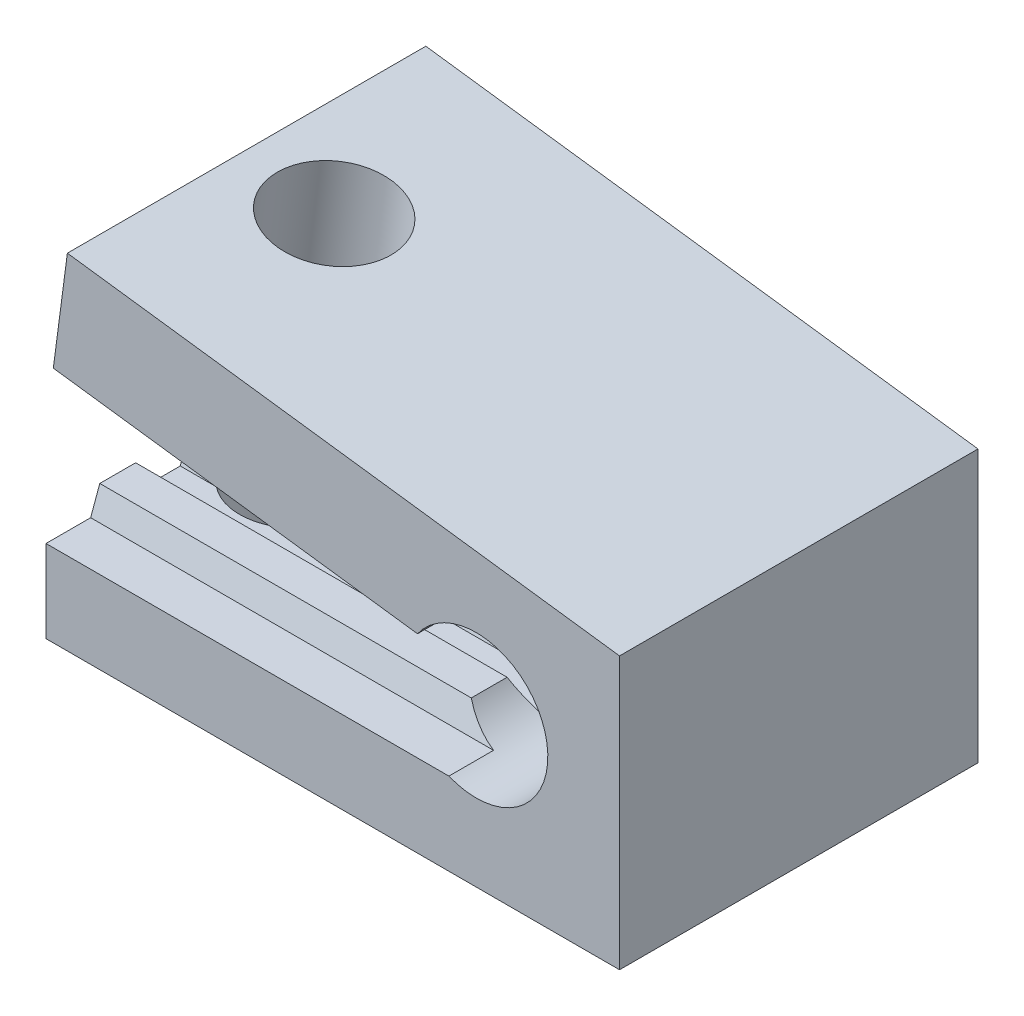
ISO-10303-21;
HEADER;
FILE_DESCRIPTION(('STEP AP214'),'2;1');
FILE_NAME('part.step','',(''),(''),'','','');
FILE_SCHEMA(('AUTOMOTIVE_DESIGN { 1 0 10303 214 1 1 1 1 }'));
ENDSEC;
DATA;
#1=APPLICATION_CONTEXT('core data for automotive mechanical design processes');
#2=APPLICATION_PROTOCOL_DEFINITION('international standard','automotive_design',2000,#1);
#3=PRODUCT_CONTEXT('',#1,'mechanical');
#4=PRODUCT('Part','Part','',(#3));
#5=PRODUCT_RELATED_PRODUCT_CATEGORY('part','',(#4));
#6=PRODUCT_DEFINITION_FORMATION('','',#4);
#7=PRODUCT_DEFINITION_CONTEXT('part definition',#1,'design');
#8=PRODUCT_DEFINITION('design','',#6,#7);
#9=PRODUCT_DEFINITION_SHAPE('','',#8);
#10=(LENGTH_UNIT() NAMED_UNIT(*) SI_UNIT(.MILLI.,.METRE.));
#11=(NAMED_UNIT(*) PLANE_ANGLE_UNIT() SI_UNIT($,.RADIAN.));
#12=(NAMED_UNIT(*) SI_UNIT($,.STERADIAN.) SOLID_ANGLE_UNIT());
#13=UNCERTAINTY_MEASURE_WITH_UNIT(LENGTH_MEASURE(1.E-05),#10,'distance_accuracy_value','');
#14=(GEOMETRIC_REPRESENTATION_CONTEXT(3) GLOBAL_UNCERTAINTY_ASSIGNED_CONTEXT((#13)) GLOBAL_UNIT_ASSIGNED_CONTEXT((#10,
#11,#12)) REPRESENTATION_CONTEXT('',''));
#15=CARTESIAN_POINT('',(0.,0.,0.));
#16=DIRECTION('',(0.,0.,1.));
#17=DIRECTION('',(1.,0.,0.));
#18=AXIS2_PLACEMENT_3D('',#15,#16,#17);
#19=CARTESIAN_POINT('',(0.,2.65,5.));
#20=DIRECTION('',(0.,0.,-1.));
#21=DIRECTION('',(-1.,0.,0.));
#22=AXIS2_PLACEMENT_3D('',#19,#20,#21);
#23=CYLINDRICAL_SURFACE('',#22,2.);
#24=DIRECTION('',(0.,0.,-1.));
#25=VECTOR('',#24,1.);
#26=CARTESIAN_POINT('',(-0.759934207678538,0.800000000000007,5.));
#27=LINE('',#26,#25);
#28=CARTESIAN_POINT('',(-0.759934207678538,0.800000000000007,5.));
#29=VERTEX_POINT('',#28);
#30=CARTESIAN_POINT('',(-0.759934207678538,0.800000000000007,3.75477916398634));
#31=VERTEX_POINT('',#30);
#32=EDGE_CURVE('E333',#29,#31,#27,.T.);
#33=ORIENTED_EDGE('',*,*,#32,.F.);
#34=CARTESIAN_POINT('',(0.,2.65,5.));
#35=DIRECTION('',(0.,0.,-1.));
#36=DIRECTION('',(1.,0.,0.));
#37=AXIS2_PLACEMENT_3D('',#34,#35,#36);
#38=CIRCLE('',#37,2.);
#39=CARTESIAN_POINT('',(-1.63630681719536,3.8,5.));
#40=VERTEX_POINT('',#39);
#41=EDGE_CURVE('E293',#40,#29,#38,.T.);
#42=ORIENTED_EDGE('',*,*,#41,.F.);
#43=DIRECTION('',(0.,0.,-1.));
#44=VECTOR('',#43,1.);
#45=CARTESIAN_POINT('',(-1.63630681719536,3.8,5.));
#46=LINE('',#45,#44);
#47=CARTESIAN_POINT('',(-1.63630681719536,3.8,-5.));
#48=VERTEX_POINT('',#47);
#49=EDGE_CURVE('E283',#40,#48,#46,.T.);
#50=ORIENTED_EDGE('',*,*,#49,.T.);
#51=CARTESIAN_POINT('',(0.,2.65,-5.));
#52=DIRECTION('',(0.,0.,-1.));
#53=DIRECTION('',(1.,0.,0.));
#54=AXIS2_PLACEMENT_3D('',#51,#52,#53);
#55=CIRCLE('',#54,2.);
#56=CARTESIAN_POINT('',(-1.63630681719536,1.5,-5.));
#57=VERTEX_POINT('',#56);
#58=EDGE_CURVE('E298',#48,#57,#55,.T.);
#59=ORIENTED_EDGE('',*,*,#58,.T.);
#60=DIRECTION('',(0.,0.,-1.));
#61=VECTOR('',#60,1.);
#62=CARTESIAN_POINT('',(-1.63630681719536,1.5,5.));
#63=LINE('',#62,#61);
#64=CARTESIAN_POINT('',(-1.63630681719536,1.50000000000001,-4.));
#65=VERTEX_POINT('',#64);
#66=EDGE_CURVE('E287',#65,#57,#63,.T.);
#67=ORIENTED_EDGE('',*,*,#66,.F.);
#68=CARTESIAN_POINT('',(0.,2.65,-4.41856576940613));
#69=DIRECTION('',(0.,0.342020143325668,0.939692620785909));
#70=DIRECTION('',(0.,0.939692620785909,-0.342020143325668));
#71=AXIS2_PLACEMENT_3D('',#68,#69,#70);
#72=ELLIPSE('',#71,2.12835554495182,2.);
#73=CARTESIAN_POINT('',(-0.759934207678538,0.800000000000007,-3.74522083601366));
#74=VERTEX_POINT('',#73);
#75=EDGE_CURVE('E459',#74,#65,#72,.F.);
#76=ORIENTED_EDGE('',*,*,#75,.F.);
#77=DIRECTION('',(0.,0.,-1.));
#78=VECTOR('',#77,1.);
#79=CARTESIAN_POINT('',(-0.759934207678533,0.800000000000005,5.));
#80=LINE('',#79,#78);
#81=CARTESIAN_POINT('',(-0.759934207678533,0.800000000000005,-2.75477916398634));
#82=VERTEX_POINT('',#81);
#83=EDGE_CURVE('E468',#82,#74,#80,.T.);
#84=ORIENTED_EDGE('',*,*,#83,.F.);
#85=CARTESIAN_POINT('',(0.,2.65,-2.08143423059387));
#86=DIRECTION('',(0.,0.342020143325669,-0.939692620785908));
#87=DIRECTION('',(0.,-0.939692620785908,-0.342020143325669));
#88=AXIS2_PLACEMENT_3D('',#85,#86,#87);
#89=ELLIPSE('',#88,2.12835554495182,2.);
#90=CARTESIAN_POINT('',(-1.63630681719536,1.5,-2.5));
#91=VERTEX_POINT('',#90);
#92=EDGE_CURVE('E471',#91,#82,#89,.F.);
#93=ORIENTED_EDGE('',*,*,#92,.F.);
#94=CARTESIAN_POINT('',(-1.63630681719536,1.5,-1.5));
#95=VERTEX_POINT('',#94);
#96=EDGE_CURVE('E289',#95,#91,#63,.T.);
#97=ORIENTED_EDGE('',*,*,#96,.F.);
#98=CARTESIAN_POINT('',(0.,2.65,-1.91856576940613));
#99=DIRECTION('',(0.,0.342020143325668,0.939692620785909));
#100=DIRECTION('',(0.,0.939692620785909,-0.342020143325668));
#101=AXIS2_PLACEMENT_3D('',#98,#99,#100);
#102=ELLIPSE('',#101,2.12835554495182,2.);
#103=CARTESIAN_POINT('',(-0.759934207678538,0.800000000000007,-1.24522083601366));
#104=VERTEX_POINT('',#103);
#105=EDGE_CURVE('E350',#104,#95,#102,.F.);
#106=ORIENTED_EDGE('',*,*,#105,.F.);
#107=DIRECTION('',(0.,0.,-1.));
#108=VECTOR('',#107,1.);
#109=CARTESIAN_POINT('',(-0.759934207678535,0.800000000000006,5.));
#110=LINE('',#109,#108);
#111=CARTESIAN_POINT('',(-0.759934207678535,0.800000000000006,-0.254779163986342));
#112=VERTEX_POINT('',#111);
#113=EDGE_CURVE('E347',#112,#104,#110,.T.);
#114=ORIENTED_EDGE('',*,*,#113,.F.);
#115=CARTESIAN_POINT('',(0.,2.65,0.418565769406133));
#116=DIRECTION('',(0.,0.342020143325669,-0.939692620785908));
#117=DIRECTION('',(0.,-0.939692620785908,-0.342020143325669));
#118=AXIS2_PLACEMENT_3D('',#115,#116,#117);
#119=ELLIPSE('',#118,2.12835554495182,2.);
#120=CARTESIAN_POINT('',(-1.63630681719536,1.5,0.));
#121=VERTEX_POINT('',#120);
#122=EDGE_CURVE('E344',#121,#112,#119,.F.);
#123=ORIENTED_EDGE('',*,*,#122,.F.);
#124=CARTESIAN_POINT('',(-1.63630681719536,1.5,1.));
#125=VERTEX_POINT('',#124);
#126=EDGE_CURVE('E513',#125,#121,#63,.T.);
#127=ORIENTED_EDGE('',*,*,#126,.F.);
#128=CARTESIAN_POINT('',(0.,2.65,0.581434230593869));
#129=DIRECTION('',(0.,0.342020143325668,0.939692620785909));
#130=DIRECTION('',(0.,0.939692620785909,-0.342020143325668));
#131=AXIS2_PLACEMENT_3D('',#128,#129,#130);
#132=ELLIPSE('',#131,2.12835554495182,2.);
#133=CARTESIAN_POINT('',(-0.759934207678538,0.800000000000007,1.25477916398634));
#134=VERTEX_POINT('',#133);
#135=EDGE_CURVE('E341',#134,#125,#132,.F.);
#136=ORIENTED_EDGE('',*,*,#135,.F.);
#137=DIRECTION('',(0.,0.,-1.));
#138=VECTOR('',#137,1.);
#139=CARTESIAN_POINT('',(-0.759934207678536,0.800000000000006,5.));
#140=LINE('',#139,#138);
#141=CARTESIAN_POINT('',(-0.759934207678536,0.800000000000006,2.24522083601366));
#142=VERTEX_POINT('',#141);
#143=EDGE_CURVE('E338',#142,#134,#140,.T.);
#144=ORIENTED_EDGE('',*,*,#143,.F.);
#145=CARTESIAN_POINT('',(0.,2.65,2.91856576940613));
#146=DIRECTION('',(0.,0.342020143325669,-0.939692620785908));
#147=DIRECTION('',(0.,-0.939692620785908,-0.342020143325669));
#148=AXIS2_PLACEMENT_3D('',#145,#146,#147);
#149=ELLIPSE('',#148,2.12835554495182,2.);
#150=CARTESIAN_POINT('',(-1.63630681719536,1.5,2.5));
#151=VERTEX_POINT('',#150);
#152=EDGE_CURVE('E45',#151,#142,#149,.F.);
#153=ORIENTED_EDGE('',*,*,#152,.F.);
#154=CARTESIAN_POINT('',(-1.63630681719536,1.50000000000001,3.5));
#155=VERTEX_POINT('',#154);
#156=EDGE_CURVE('E286',#155,#151,#63,.T.);
#157=ORIENTED_EDGE('',*,*,#156,.F.);
#158=CARTESIAN_POINT('',(0.,2.65,3.08143423059387));
#159=DIRECTION('',(0.,0.342020143325668,0.939692620785909));
#160=DIRECTION('',(0.,0.939692620785909,-0.342020143325668));
#161=AXIS2_PLACEMENT_3D('',#158,#159,#160);
#162=ELLIPSE('',#161,2.12835554495182,2.);
#163=EDGE_CURVE('E11',#31,#155,#162,.F.);
#164=ORIENTED_EDGE('',*,*,#163,.F.);
#165=EDGE_LOOP('',(#33,#42,#50,#59,#67,#76,#84,#93,#97,#106,#114,#123,#127,#136,#144,#153,#157,#164));
#166=FACE_BOUND('',#165,.T.);
#167=ADVANCED_FACE('F37',(#166),#23,.F.);
#168=CARTESIAN_POINT('',(-1.63630681719536,1.5,5.));
#169=DIRECTION('',(0.,-1.,0.));
#170=DIRECTION('',(1.,0.,0.));
#171=AXIS2_PLACEMENT_3D('',#168,#169,#170);
#172=PLANE('',#171);
#173=DIRECTION('',(0.,0.,-1.));
#174=VECTOR('',#173,1.);
#175=CARTESIAN_POINT('',(-12.,1.5,5.));
#176=LINE('',#175,#174);
#177=CARTESIAN_POINT('',(-12.,1.5,3.5));
#178=VERTEX_POINT('',#177);
#179=CARTESIAN_POINT('',(-12.,1.5,2.5));
#180=VERTEX_POINT('',#179);
#181=EDGE_CURVE('E290',#178,#180,#176,.T.);
#182=ORIENTED_EDGE('',*,*,#181,.F.);
#183=DIRECTION('',(1.,0.,0.));
#184=VECTOR('',#183,1.);
#185=CARTESIAN_POINT('',(-38.4689427634904,1.49999999999998,3.5));
#186=LINE('',#185,#184);
#187=EDGE_CURVE('E359',#178,#155,#186,.T.);
#188=ORIENTED_EDGE('',*,*,#187,.T.);
#189=ORIENTED_EDGE('',*,*,#156,.T.);
#190=DIRECTION('',(1.,0.,0.));
#191=VECTOR('',#190,1.);
#192=CARTESIAN_POINT('',(-38.4689427634904,1.49999999999998,2.5));
#193=LINE('',#192,#191);
#194=EDGE_CURVE('E362',#180,#151,#193,.T.);
#195=ORIENTED_EDGE('',*,*,#194,.F.);
#196=EDGE_LOOP('',(#182,#188,#189,#195));
#197=FACE_BOUND('',#196,.T.);
#198=ADVANCED_FACE('F420',(#197),#172,.F.);
#199=CARTESIAN_POINT('',(-12.,1.5,1.));
#200=VERTEX_POINT('',#199);
#201=CARTESIAN_POINT('',(-12.,1.5,0.));
#202=VERTEX_POINT('',#201);
#203=EDGE_CURVE('E422',#200,#202,#176,.T.);
#204=ORIENTED_EDGE('',*,*,#203,.F.);
#205=DIRECTION('',(1.,0.,0.));
#206=VECTOR('',#205,1.);
#207=CARTESIAN_POINT('',(-38.4689427634904,1.49999999999998,1.));
#208=LINE('',#207,#206);
#209=CARTESIAN_POINT('',(-11.2489995996797,1.5,1.));
#210=VERTEX_POINT('',#209);
#211=EDGE_CURVE('E372',#200,#210,#208,.T.);
#212=ORIENTED_EDGE('',*,*,#211,.T.);
#213=CARTESIAN_POINT('',(-9.99999999999999,1.5,0.));
#214=DIRECTION('',(0.,-1.,0.));
#215=DIRECTION('',(1.,0.,0.));
#216=AXIS2_PLACEMENT_3D('',#213,#214,#215);
#217=CIRCLE('',#216,1.6);
#218=CARTESIAN_POINT('',(-11.6,1.5,0.));
#219=VERTEX_POINT('',#218);
#220=EDGE_CURVE('E233',#219,#210,#217,.F.);
#221=ORIENTED_EDGE('',*,*,#220,.F.);
#222=DIRECTION('',(1.,0.,0.));
#223=VECTOR('',#222,1.);
#224=CARTESIAN_POINT('',(-38.4689427634904,1.49999999999998,0.));
#225=LINE('',#224,#223);
#226=EDGE_CURVE('E375',#202,#219,#225,.T.);
#227=ORIENTED_EDGE('',*,*,#226,.F.);
#228=EDGE_LOOP('',(#204,#212,#221,#227));
#229=FACE_BOUND('',#228,.T.);
#230=ADVANCED_FACE('F499',(#229),#172,.F.);
#231=CARTESIAN_POINT('',(-8.75100040032031,1.5,1.));
#232=VERTEX_POINT('',#231);
#233=CARTESIAN_POINT('',(-8.39999999999999,1.5,0.));
#234=VERTEX_POINT('',#233);
#235=EDGE_CURVE('E235',#232,#234,#217,.F.);
#236=ORIENTED_EDGE('',*,*,#235,.F.);
#237=EDGE_CURVE('E374',#232,#125,#208,.T.);
#238=ORIENTED_EDGE('',*,*,#237,.T.);
#239=ORIENTED_EDGE('',*,*,#126,.T.);
#240=EDGE_CURVE('E378',#234,#121,#225,.T.);
#241=ORIENTED_EDGE('',*,*,#240,.F.);
#242=EDGE_LOOP('',(#236,#238,#239,#241));
#243=FACE_BOUND('',#242,.T.);
#244=ADVANCED_FACE('F508',(#243),#172,.F.);
#245=CARTESIAN_POINT('',(-12.,1.5,-1.5));
#246=VERTEX_POINT('',#245);
#247=CARTESIAN_POINT('',(-12.,1.5,-2.5));
#248=VERTEX_POINT('',#247);
#249=EDGE_CURVE('E241',#246,#248,#176,.T.);
#250=ORIENTED_EDGE('',*,*,#249,.F.);
#251=DIRECTION('',(1.,0.,0.));
#252=VECTOR('',#251,1.);
#253=CARTESIAN_POINT('',(-38.4689427634904,1.49999999999998,-1.5));
#254=LINE('',#253,#252);
#255=CARTESIAN_POINT('',(-10.556776436283,1.5,-1.5));
#256=VERTEX_POINT('',#255);
#257=EDGE_CURVE('E238',#246,#256,#254,.T.);
#258=ORIENTED_EDGE('',*,*,#257,.T.);
#259=CARTESIAN_POINT('',(-9.44322356371699,1.5,-1.5));
#260=VERTEX_POINT('',#259);
#261=EDGE_CURVE('E222',#260,#256,#217,.F.);
#262=ORIENTED_EDGE('',*,*,#261,.F.);
#263=EDGE_CURVE('E245',#260,#95,#254,.T.);
#264=ORIENTED_EDGE('',*,*,#263,.T.);
#265=ORIENTED_EDGE('',*,*,#96,.T.);
#266=DIRECTION('',(1.,0.,0.));
#267=VECTOR('',#266,1.);
#268=CARTESIAN_POINT('',(-38.4689427634904,1.49999999999998,-2.5));
#269=LINE('',#268,#267);
#270=EDGE_CURVE('E384',#248,#91,#269,.T.);
#271=ORIENTED_EDGE('',*,*,#270,.F.);
#272=EDGE_LOOP('',(#250,#258,#262,#264,#265,#271));
#273=FACE_BOUND('',#272,.T.);
#274=ADVANCED_FACE('F239',(#273),#172,.F.);
#275=CARTESIAN_POINT('',(-9.99999999999999,8.11282375258911,0.));
#276=DIRECTION('',(0.,-1.,0.));
#277=DIRECTION('',(1.,0.,0.));
#278=AXIS2_PLACEMENT_3D('',#275,#276,#277);
#279=CYLINDRICAL_SURFACE('',#278,1.6);
#280=CARTESIAN_POINT('',(-9.99999999999999,-1.5,0.));
#281=DIRECTION('',(0.,-1.,0.));
#282=DIRECTION('',(1.,0.,0.));
#283=AXIS2_PLACEMENT_3D('',#280,#281,#282);
#284=CIRCLE('',#283,1.6);
#285=CARTESIAN_POINT('',(-8.39999999999999,-1.5,0.));
#286=VERTEX_POINT('',#285);
#287=EDGE_CURVE('E331',#286,#286,#284,.T.);
#288=ORIENTED_EDGE('',*,*,#287,.T.);
#289=EDGE_LOOP('',(#288));
#290=FACE_BOUND('',#289,.T.);
#291=CARTESIAN_POINT('',(-9.99999999999999,4.24747741945463,0.));
#292=DIRECTION('',(0.,0.342020143325668,0.939692620785909));
#293=DIRECTION('',(0.,-0.939692620785909,0.342020143325668));
#294=AXIS2_PLACEMENT_3D('',#291,#292,#293);
#295=ELLIPSE('',#294,4.67808704026095,1.6);
#296=CARTESIAN_POINT('',(-10.9927382583671,0.8,1.25477916398634));
#297=VERTEX_POINT('',#296);
#298=EDGE_CURVE('E469',#297,#210,#295,.F.);
#299=ORIENTED_EDGE('',*,*,#298,.F.);
#300=CARTESIAN_POINT('',(-9.99999999999999,0.800000000000001,0.));
#301=DIRECTION('',(0.,1.,0.));
#302=DIRECTION('',(-1.,0.,0.));
#303=AXIS2_PLACEMENT_3D('',#300,#301,#302);
#304=CIRCLE('',#303,1.6);
#305=CARTESIAN_POINT('',(-9.00726174163289,0.800000000000002,1.25477916398634));
#306=VERTEX_POINT('',#305);
#307=EDGE_CURVE('E474',#306,#297,#304,.F.);
#308=ORIENTED_EDGE('',*,*,#307,.F.);
#309=EDGE_CURVE('E476',#232,#306,#295,.F.);
#310=ORIENTED_EDGE('',*,*,#309,.F.);
#311=ORIENTED_EDGE('',*,*,#235,.T.);
#312=CARTESIAN_POINT('',(-9.99999999999999,1.5,0.));
#313=DIRECTION('',(0.,0.342020143325669,-0.939692620785908));
#314=DIRECTION('',(0.,-0.939692620785908,-0.342020143325669));
#315=AXIS2_PLACEMENT_3D('',#312,#313,#314);
#316=ELLIPSE('',#315,4.67808704026094,1.6);
#317=CARTESIAN_POINT('',(-8.42041537814575,0.800000000000002,-0.254779163986342));
#318=VERTEX_POINT('',#317);
#319=EDGE_CURVE('E252',#318,#234,#316,.F.);
#320=ORIENTED_EDGE('',*,*,#319,.F.);
#321=CARTESIAN_POINT('',(-9.99999999999999,0.800000000000001,0.));
#322=DIRECTION('',(0.,1.,0.));
#323=DIRECTION('',(-1.,0.,0.));
#324=AXIS2_PLACEMENT_3D('',#321,#322,#323);
#325=CIRCLE('',#324,1.6);
#326=CARTESIAN_POINT('',(-8.99529851719157,0.800000000000002,-1.24522083601366));
#327=VERTEX_POINT('',#326);
#328=EDGE_CURVE('E256',#327,#318,#325,.F.);
#329=ORIENTED_EDGE('',*,*,#328,.F.);
#330=CARTESIAN_POINT('',(-10.,-2.62121612918194,0.));
#331=DIRECTION('',(0.,0.342020143325668,0.939692620785909));
#332=DIRECTION('',(0.,-0.939692620785909,0.342020143325668));
#333=AXIS2_PLACEMENT_3D('',#330,#331,#332);
#334=ELLIPSE('',#333,4.67808704026095,1.6);
#335=EDGE_CURVE('E229',#260,#327,#334,.F.);
#336=ORIENTED_EDGE('',*,*,#335,.F.);
#337=ORIENTED_EDGE('',*,*,#261,.T.);
#338=CARTESIAN_POINT('',(-11.0047014828084,0.800000000000001,-1.24522083601366));
#339=VERTEX_POINT('',#338);
#340=EDGE_CURVE('E226',#339,#256,#334,.F.);
#341=ORIENTED_EDGE('',*,*,#340,.F.);
#342=CARTESIAN_POINT('',(-11.5795846218542,0.8,-0.254779163986342));
#343=VERTEX_POINT('',#342);
#344=EDGE_CURVE('E251',#343,#339,#325,.F.);
#345=ORIENTED_EDGE('',*,*,#344,.F.);
#346=EDGE_CURVE('E254',#219,#343,#316,.F.);
#347=ORIENTED_EDGE('',*,*,#346,.F.);
#348=ORIENTED_EDGE('',*,*,#220,.T.);
#349=EDGE_LOOP('',(#299,#308,#310,#311,#320,#329,#336,#337,#341,#345,#347,#348));
#350=FACE_BOUND('',#349,.T.);
#351=ADVANCED_FACE('F224',(#290,#350),#279,.F.);
#352=CARTESIAN_POINT('',(-12.,-1.5,5.));
#353=DIRECTION('',(1.,0.,0.));
#354=DIRECTION('',(0.,0.,-1.));
#355=AXIS2_PLACEMENT_3D('',#352,#353,#354);
#356=PLANE('',#355);
#357=DIRECTION('',(0.,-1.,0.));
#358=VECTOR('',#357,1.);
#359=CARTESIAN_POINT('',(-12.,-1.5,5.));
#360=LINE('',#359,#358);
#361=CARTESIAN_POINT('',(-12.,0.800000000000003,5.));
#362=VERTEX_POINT('',#361);
#363=CARTESIAN_POINT('',(-12.,-1.5,5.));
#364=VERTEX_POINT('',#363);
#365=EDGE_CURVE('E297',#362,#364,#360,.T.);
#366=ORIENTED_EDGE('',*,*,#365,.F.);
#367=DIRECTION('',(0.,0.,-1.));
#368=VECTOR('',#367,1.);
#369=CARTESIAN_POINT('',(-12.,0.8,3.75477916398634));
#370=LINE('',#369,#368);
#371=CARTESIAN_POINT('',(-12.,0.8,3.75477916398634));
#372=VERTEX_POINT('',#371);
#373=EDGE_CURVE('E52',#362,#372,#370,.T.);
#374=ORIENTED_EDGE('',*,*,#373,.T.);
#375=DIRECTION('',(0.,0.939692620785909,-0.342020143325668));
#376=VECTOR('',#375,1.);
#377=CARTESIAN_POINT('',(-12.,1.49999999999999,3.5));
#378=LINE('',#377,#376);
#379=EDGE_CURVE('E413',#372,#178,#378,.T.);
#380=ORIENTED_EDGE('',*,*,#379,.T.);
#381=ORIENTED_EDGE('',*,*,#181,.T.);
#382=DIRECTION('',(0.,-0.939692620785908,-0.342020143325669));
#383=VECTOR('',#382,1.);
#384=CARTESIAN_POINT('',(-12.,1.49999999999999,2.49999999999999));
#385=LINE('',#384,#383);
#386=CARTESIAN_POINT('',(-12.,0.8,2.24522083601366));
#387=VERTEX_POINT('',#386);
#388=EDGE_CURVE('E59',#180,#387,#385,.T.);
#389=ORIENTED_EDGE('',*,*,#388,.T.);
#390=DIRECTION('',(0.,0.,-1.));
#391=VECTOR('',#390,1.);
#392=CARTESIAN_POINT('',(-12.,0.8,1.25477916398634));
#393=LINE('',#392,#391);
#394=CARTESIAN_POINT('',(-12.,0.8,1.25477916398634));
#395=VERTEX_POINT('',#394);
#396=EDGE_CURVE('E410',#387,#395,#393,.T.);
#397=ORIENTED_EDGE('',*,*,#396,.T.);
#398=DIRECTION('',(0.,0.939692620785909,-0.342020143325668));
#399=VECTOR('',#398,1.);
#400=CARTESIAN_POINT('',(-12.,1.49999999999999,1.00000000000001));
#401=LINE('',#400,#399);
#402=EDGE_CURVE('E408',#395,#200,#401,.T.);
#403=ORIENTED_EDGE('',*,*,#402,.T.);
#404=ORIENTED_EDGE('',*,*,#203,.T.);
#405=DIRECTION('',(0.,-0.939692620785908,-0.342020143325669));
#406=VECTOR('',#405,1.);
#407=CARTESIAN_POINT('',(-12.,1.49999999999999,0.));
#408=LINE('',#407,#406);
#409=CARTESIAN_POINT('',(-12.,0.8,-0.254779163986342));
#410=VERTEX_POINT('',#409);
#411=EDGE_CURVE('E406',#202,#410,#408,.T.);
#412=ORIENTED_EDGE('',*,*,#411,.T.);
#413=DIRECTION('',(0.,0.,-1.));
#414=VECTOR('',#413,1.);
#415=CARTESIAN_POINT('',(-12.,0.8,-1.24522083601366));
#416=LINE('',#415,#414);
#417=CARTESIAN_POINT('',(-12.,0.8,-1.24522083601366));
#418=VERTEX_POINT('',#417);
#419=EDGE_CURVE('E404',#410,#418,#416,.T.);
#420=ORIENTED_EDGE('',*,*,#419,.T.);
#421=DIRECTION('',(0.,0.939692620785909,-0.342020143325668));
#422=VECTOR('',#421,1.);
#423=CARTESIAN_POINT('',(-12.,1.49999999999999,-1.5));
#424=LINE('',#423,#422);
#425=EDGE_CURVE('E402',#418,#246,#424,.T.);
#426=ORIENTED_EDGE('',*,*,#425,.T.);
#427=ORIENTED_EDGE('',*,*,#249,.T.);
#428=DIRECTION('',(0.,-0.939692620785908,-0.342020143325669));
#429=VECTOR('',#428,1.);
#430=CARTESIAN_POINT('',(-12.,1.49999999999999,-2.5));
#431=LINE('',#430,#429);
#432=CARTESIAN_POINT('',(-12.,0.8,-2.75477916398634));
#433=VERTEX_POINT('',#432);
#434=EDGE_CURVE('E400',#248,#433,#431,.T.);
#435=ORIENTED_EDGE('',*,*,#434,.T.);
#436=DIRECTION('',(0.,0.,-1.));
#437=VECTOR('',#436,1.);
#438=CARTESIAN_POINT('',(-12.,0.8,-3.74522083601366));
#439=LINE('',#438,#437);
#440=CARTESIAN_POINT('',(-12.,0.800000000000001,-3.74522083601366));
#441=VERTEX_POINT('',#440);
#442=EDGE_CURVE('E398',#433,#441,#439,.T.);
#443=ORIENTED_EDGE('',*,*,#442,.T.);
#444=DIRECTION('',(0.,0.939692620785909,-0.342020143325668));
#445=VECTOR('',#444,1.);
#446=CARTESIAN_POINT('',(-12.,1.49999999999999,-3.99999999999999));
#447=LINE('',#446,#445);
#448=CARTESIAN_POINT('',(-12.,1.5,-4.));
#449=VERTEX_POINT('',#448);
#450=EDGE_CURVE('E396',#441,#449,#447,.T.);
#451=ORIENTED_EDGE('',*,*,#450,.T.);
#452=CARTESIAN_POINT('',(-12.,1.5,-5.));
#453=VERTEX_POINT('',#452);
#454=EDGE_CURVE('E291',#449,#453,#176,.T.);
#455=ORIENTED_EDGE('',*,*,#454,.T.);
#456=DIRECTION('',(0.,-1.,0.));
#457=VECTOR('',#456,1.);
#458=CARTESIAN_POINT('',(-12.,-1.5,-5.));
#459=LINE('',#458,#457);
#460=CARTESIAN_POINT('',(-12.,-1.5,-5.));
#461=VERTEX_POINT('',#460);
#462=EDGE_CURVE('E311',#453,#461,#459,.T.);
#463=ORIENTED_EDGE('',*,*,#462,.T.);
#464=DIRECTION('',(0.,0.,-1.));
#465=VECTOR('',#464,1.);
#466=CARTESIAN_POINT('',(-12.,-1.5,5.));
#467=LINE('',#466,#465);
#468=EDGE_CURVE('E260',#364,#461,#467,.T.);
#469=ORIENTED_EDGE('',*,*,#468,.F.);
#470=EDGE_LOOP('',(#366,#374,#380,#381,#389,#397,#403,#404,#412,#420,#426,#427,#435,#443,#451,
#455,#463,#469));
#471=FACE_BOUND('',#470,.T.);
#472=ADVANCED_FACE('F39',(#471),#356,.F.);
#473=CARTESIAN_POINT('',(4.,-1.5,5.));
#474=DIRECTION('',(0.,1.,0.));
#475=DIRECTION('',(-1.,0.,0.));
#476=AXIS2_PLACEMENT_3D('',#473,#474,#475);
#477=PLANE('',#476);
#478=ORIENTED_EDGE('',*,*,#287,.F.);
#479=EDGE_LOOP('',(#478));
#480=FACE_BOUND('',#479,.T.);
#481=DIRECTION('',(1.,0.,0.));
#482=VECTOR('',#481,1.);
#483=CARTESIAN_POINT('',(4.,-1.5,-5.));
#484=LINE('',#483,#482);
#485=CARTESIAN_POINT('',(4.,-1.5,-5.));
#486=VERTEX_POINT('',#485);
#487=EDGE_CURVE('E309',#461,#486,#484,.T.);
#488=ORIENTED_EDGE('',*,*,#487,.T.);
#489=DIRECTION('',(0.,0.,-1.));
#490=VECTOR('',#489,1.);
#491=CARTESIAN_POINT('',(4.,-1.5,5.));
#492=LINE('',#491,#490);
#493=CARTESIAN_POINT('',(4.,-1.5,5.));
#494=VERTEX_POINT('',#493);
#495=EDGE_CURVE('E266',#494,#486,#492,.T.);
#496=ORIENTED_EDGE('',*,*,#495,.F.);
#497=DIRECTION('',(1.,0.,0.));
#498=VECTOR('',#497,1.);
#499=CARTESIAN_POINT('',(4.,-1.5,5.));
#500=LINE('',#499,#498);
#501=EDGE_CURVE('E324',#364,#494,#500,.T.);
#502=ORIENTED_EDGE('',*,*,#501,.F.);
#503=ORIENTED_EDGE('',*,*,#468,.T.);
#504=EDGE_LOOP('',(#488,#496,#502,#503));
#505=FACE_BOUND('',#504,.T.);
#506=ADVANCED_FACE('F439',(#480,#505),#477,.F.);
#507=CARTESIAN_POINT('',(4.,-1.5,5.));
#508=DIRECTION('',(-1.,0.,0.));
#509=DIRECTION('',(0.,0.,1.));
#510=AXIS2_PLACEMENT_3D('',#507,#508,#509);
#511=PLANE('',#510);
#512=DIRECTION('',(0.,1.,0.));
#513=VECTOR('',#512,1.);
#514=CARTESIAN_POINT('',(4.,-1.5,-5.));
#515=LINE('',#514,#513);
#516=CARTESIAN_POINT('',(4.,6.08385301208783,-5.));
#517=VERTEX_POINT('',#516);
#518=EDGE_CURVE('E307',#486,#517,#515,.T.);
#519=ORIENTED_EDGE('',*,*,#518,.T.);
#520=DIRECTION('',(0.,0.,-1.));
#521=VECTOR('',#520,1.);
#522=CARTESIAN_POINT('',(4.,6.08385301208783,5.));
#523=LINE('',#522,#521);
#524=CARTESIAN_POINT('',(4.,6.08385301208783,5.));
#525=VERTEX_POINT('',#524);
#526=EDGE_CURVE('E272',#525,#517,#523,.T.);
#527=ORIENTED_EDGE('',*,*,#526,.F.);
#528=DIRECTION('',(0.,1.,0.));
#529=VECTOR('',#528,1.);
#530=CARTESIAN_POINT('',(4.,-1.5,5.));
#531=LINE('',#530,#529);
#532=EDGE_CURVE('E322',#494,#525,#531,.T.);
#533=ORIENTED_EDGE('',*,*,#532,.F.);
#534=ORIENTED_EDGE('',*,*,#495,.T.);
#535=EDGE_LOOP('',(#519,#527,#533,#534));
#536=FACE_BOUND('',#535,.T.);
#537=ADVANCED_FACE('F442',(#536),#511,.F.);
#538=CARTESIAN_POINT('',(4.,6.08385301208783,5.));
#539=DIRECTION('',(-0.130526192220051,-0.99144486137381,0.));
#540=DIRECTION('',(0.99144486137381,-0.130526192220051,0.));
#541=AXIS2_PLACEMENT_3D('',#538,#539,#540);
#542=PLANE('',#541);
#543=CARTESIAN_POINT('',(-8.95984726661253,7.79004927308855,0.));
#544=DIRECTION('',(0.130526192220051,0.991444861373811,0.));
#545=DIRECTION('',(-0.99144486137381,0.130526192220051,0.));
#546=AXIS2_PLACEMENT_3D('',#543,#544,#545);
#547=CIRCLE('',#546,1.6);
#548=CARTESIAN_POINT('',(-10.5461590448106,7.99889118064063,0.));
#549=VERTEX_POINT('',#548);
#550=EDGE_CURVE('E232',#549,#549,#547,.T.);
#551=ORIENTED_EDGE('',*,*,#550,.F.);
#552=EDGE_LOOP('',(#551));
#553=FACE_BOUND('',#552,.T.);
#554=DIRECTION('',(-0.99144486137381,0.130526192220051,0.));
#555=VECTOR('',#554,1.);
#556=CARTESIAN_POINT('',(4.,6.08385301208783,-5.));
#557=LINE('',#556,#555);
#558=CARTESIAN_POINT('',(-11.4039670926489,8.11182375258911,-5.));
#559=VERTEX_POINT('',#558);
#560=EDGE_CURVE('E305',#517,#559,#557,.T.);
#561=ORIENTED_EDGE('',*,*,#560,.T.);
#562=DIRECTION('',(0.,0.,-1.));
#563=VECTOR('',#562,1.);
#564=CARTESIAN_POINT('',(-11.4039670926489,8.11182375258911,5.));
#565=LINE('',#564,#563);
#566=CARTESIAN_POINT('',(-11.4039670926489,8.11182375258911,5.));
#567=VERTEX_POINT('',#566);
#568=EDGE_CURVE('E277',#567,#559,#565,.T.);
#569=ORIENTED_EDGE('',*,*,#568,.F.);
#570=DIRECTION('',(-0.99144486137381,0.130526192220051,0.));
#571=VECTOR('',#570,1.);
#572=CARTESIAN_POINT('',(4.,6.08385301208783,5.));
#573=LINE('',#572,#571);
#574=EDGE_CURVE('E320',#525,#567,#573,.T.);
#575=ORIENTED_EDGE('',*,*,#574,.F.);
#576=ORIENTED_EDGE('',*,*,#526,.T.);
#577=EDGE_LOOP('',(#561,#569,#575,#576));
#578=FACE_BOUND('',#577,.T.);
#579=ADVANCED_FACE('F449',(#553,#578),#542,.F.);
#580=CARTESIAN_POINT('',(-11.7955456693091,5.13748916846768,5.));
#581=DIRECTION('',(0.99144486137381,-0.130526192220051,0.));
#582=DIRECTION('',(0.130526192220051,0.99144486137381,0.));
#583=AXIS2_PLACEMENT_3D('',#580,#581,#582);
#584=PLANE('',#583);
#585=DIRECTION('',(-0.130526192220051,-0.99144486137381,0.));
#586=VECTOR('',#585,1.);
#587=CARTESIAN_POINT('',(-11.7955456693091,5.13748916846768,-5.));
#588=LINE('',#587,#586);
#589=CARTESIAN_POINT('',(-11.7955456693091,5.13748916846768,-5.));
#590=VERTEX_POINT('',#589);
#591=EDGE_CURVE('E303',#559,#590,#588,.T.);
#592=ORIENTED_EDGE('',*,*,#591,.T.);
#593=DIRECTION('',(0.,0.,-1.));
#594=VECTOR('',#593,1.);
#595=CARTESIAN_POINT('',(-11.7955456693091,5.13748916846768,5.));
#596=LINE('',#595,#594);
#597=CARTESIAN_POINT('',(-11.7955456693091,5.13748916846768,5.));
#598=VERTEX_POINT('',#597);
#599=EDGE_CURVE('E280',#598,#590,#596,.T.);
#600=ORIENTED_EDGE('',*,*,#599,.F.);
#601=DIRECTION('',(-0.130526192220051,-0.99144486137381,0.));
#602=VECTOR('',#601,1.);
#603=CARTESIAN_POINT('',(-11.7955456693091,5.13748916846768,5.));
#604=LINE('',#603,#602);
#605=EDGE_CURVE('E318',#567,#598,#604,.T.);
#606=ORIENTED_EDGE('',*,*,#605,.F.);
#607=ORIENTED_EDGE('',*,*,#568,.T.);
#608=EDGE_LOOP('',(#592,#600,#606,#607));
#609=FACE_BOUND('',#608,.T.);
#610=ADVANCED_FACE('F452',(#609),#584,.F.);
#611=CARTESIAN_POINT('',(-1.63630681719536,3.8,5.));
#612=DIRECTION('',(0.130526192220051,0.99144486137381,0.));
#613=DIRECTION('',(-0.99144486137381,0.130526192220051,0.));
#614=AXIS2_PLACEMENT_3D('',#611,#612,#613);
#615=PLANE('',#614);
#616=CARTESIAN_POINT('',(-9.35142584327268,4.81571468896712,0.));
#617=DIRECTION('',(0.130526192220051,0.99144486137381,0.));
#618=DIRECTION('',(-0.99144486137381,0.130526192220051,0.));
#619=AXIS2_PLACEMENT_3D('',#616,#617,#618);
#620=CIRCLE('',#619,1.6);
#621=CARTESIAN_POINT('',(-10.9377376214708,5.0245565965192,0.));
#622=VERTEX_POINT('',#621);
#623=EDGE_CURVE('E313',#622,#622,#620,.F.);
#624=ORIENTED_EDGE('',*,*,#623,.F.);
#625=EDGE_LOOP('',(#624));
#626=FACE_BOUND('',#625,.T.);
#627=DIRECTION('',(0.99144486137381,-0.130526192220051,0.));
#628=VECTOR('',#627,1.);
#629=CARTESIAN_POINT('',(-1.63630681719536,3.8,-5.));
#630=LINE('',#629,#628);
#631=EDGE_CURVE('E301',#590,#48,#630,.T.);
#632=ORIENTED_EDGE('',*,*,#631,.T.);
#633=ORIENTED_EDGE('',*,*,#49,.F.);
#634=DIRECTION('',(0.99144486137381,-0.130526192220051,0.));
#635=VECTOR('',#634,1.);
#636=CARTESIAN_POINT('',(-1.63630681719536,3.8,5.));
#637=LINE('',#636,#635);
#638=EDGE_CURVE('E316',#598,#40,#637,.T.);
#639=ORIENTED_EDGE('',*,*,#638,.F.);
#640=ORIENTED_EDGE('',*,*,#599,.T.);
#641=EDGE_LOOP('',(#632,#633,#639,#640));
#642=FACE_BOUND('',#641,.T.);
#643=ADVANCED_FACE('F457',(#626,#642),#615,.F.);
#644=ORIENTED_EDGE('',*,*,#454,.F.);
#645=DIRECTION('',(1.,0.,0.));
#646=VECTOR('',#645,1.);
#647=CARTESIAN_POINT('',(-38.4689427634904,1.49999999999998,-4.));
#648=LINE('',#647,#646);
#649=EDGE_CURVE('E393',#449,#65,#648,.T.);
#650=ORIENTED_EDGE('',*,*,#649,.T.);
#651=ORIENTED_EDGE('',*,*,#66,.T.);
#652=DIRECTION('',(-1.,0.,0.));
#653=VECTOR('',#652,1.);
#654=CARTESIAN_POINT('',(-1.63630681719536,1.5,-5.));
#655=LINE('',#654,#653);
#656=EDGE_CURVE('E294',#57,#453,#655,.T.);
#657=ORIENTED_EDGE('',*,*,#656,.T.);
#658=EDGE_LOOP('',(#644,#650,#651,#657));
#659=FACE_BOUND('',#658,.T.);
#660=ADVANCED_FACE('F463',(#659),#172,.F.);
#661=CARTESIAN_POINT('',(0.,2.65,5.));
#662=DIRECTION('',(0.,0.,1.));
#663=DIRECTION('',(1.,0.,0.));
#664=AXIS2_PLACEMENT_3D('',#661,#662,#663);
#665=PLANE('',#664);
#666=DIRECTION('',(1.,0.,0.));
#667=VECTOR('',#666,1.);
#668=CARTESIAN_POINT('',(-38.4689427634904,0.799999999999985,5.));
#669=LINE('',#668,#667);
#670=EDGE_CURVE('E356',#362,#29,#669,.T.);
#671=ORIENTED_EDGE('',*,*,#670,.F.);
#672=ORIENTED_EDGE('',*,*,#365,.T.);
#673=ORIENTED_EDGE('',*,*,#501,.T.);
#674=ORIENTED_EDGE('',*,*,#532,.T.);
#675=ORIENTED_EDGE('',*,*,#574,.T.);
#676=ORIENTED_EDGE('',*,*,#605,.T.);
#677=ORIENTED_EDGE('',*,*,#638,.T.);
#678=ORIENTED_EDGE('',*,*,#41,.T.);
#679=EDGE_LOOP('',(#671,#672,#673,#674,#675,#676,#677,#678));
#680=FACE_BOUND('',#679,.T.);
#681=ADVANCED_FACE('F429',(#680),#665,.T.);
#682=CARTESIAN_POINT('',(0.,2.65,-5.));
#683=DIRECTION('',(0.,0.,1.));
#684=DIRECTION('',(1.,0.,0.));
#685=AXIS2_PLACEMENT_3D('',#682,#683,#684);
#686=PLANE('',#685);
#687=ORIENTED_EDGE('',*,*,#462,.F.);
#688=ORIENTED_EDGE('',*,*,#656,.F.);
#689=ORIENTED_EDGE('',*,*,#58,.F.);
#690=ORIENTED_EDGE('',*,*,#631,.F.);
#691=ORIENTED_EDGE('',*,*,#591,.F.);
#692=ORIENTED_EDGE('',*,*,#560,.F.);
#693=ORIENTED_EDGE('',*,*,#518,.F.);
#694=ORIENTED_EDGE('',*,*,#487,.F.);
#695=EDGE_LOOP('',(#687,#688,#689,#690,#691,#692,#693,#694));
#696=FACE_BOUND('',#695,.T.);
#697=ADVANCED_FACE('F434',(#696),#686,.F.);
#698=CARTESIAN_POINT('',(-10.2140099003026,-1.73626170978912,0.));
#699=DIRECTION('',(0.130526192220051,0.99144486137381,0.));
#700=DIRECTION('',(-0.99144486137381,0.130526192220051,0.));
#701=AXIS2_PLACEMENT_3D('',#698,#699,#700);
#702=CYLINDRICAL_SURFACE('',#701,1.6);
#703=ORIENTED_EDGE('',*,*,#550,.T.);
#704=EDGE_LOOP('',(#703));
#705=FACE_BOUND('',#704,.T.);
#706=ORIENTED_EDGE('',*,*,#623,.T.);
#707=EDGE_LOOP('',(#706));
#708=FACE_BOUND('',#707,.T.);
#709=ADVANCED_FACE('F563',(#705,#708),#702,.F.);
#710=CARTESIAN_POINT('',(-38.4689427634904,1.49999999999998,-1.5));
#711=DIRECTION('',(0.,0.342020143325668,0.939692620785909));
#712=DIRECTION('',(0.,-0.939692620785909,0.342020143325668));
#713=AXIS2_PLACEMENT_3D('',#710,#711,#712);
#714=PLANE('',#713);
#715=DIRECTION('',(1.,0.,0.));
#716=VECTOR('',#715,1.);
#717=CARTESIAN_POINT('',(-38.4689427634904,0.799999999999985,-1.24522083601366));
#718=LINE('',#717,#716);
#719=EDGE_CURVE('E244',#327,#104,#718,.T.);
#720=ORIENTED_EDGE('',*,*,#719,.T.);
#721=ORIENTED_EDGE('',*,*,#105,.T.);
#722=ORIENTED_EDGE('',*,*,#263,.F.);
#723=ORIENTED_EDGE('',*,*,#335,.T.);
#724=EDGE_LOOP('',(#720,#721,#722,#723));
#725=FACE_BOUND('',#724,.T.);
#726=ADVANCED_FACE('F566',(#725),#714,.T.);
#727=CARTESIAN_POINT('',(-38.4689427634904,0.799999999999985,-1.24522083601366));
#728=DIRECTION('',(0.,1.,0.));
#729=DIRECTION('',(-1.,0.,0.));
#730=AXIS2_PLACEMENT_3D('',#727,#728,#729);
#731=PLANE('',#730);
#732=DIRECTION('',(1.,0.,0.));
#733=VECTOR('',#732,1.);
#734=CARTESIAN_POINT('',(-38.4689427634904,0.799999999999985,-0.254779163986342));
#735=LINE('',#734,#733);
#736=EDGE_CURVE('E382',#318,#112,#735,.T.);
#737=ORIENTED_EDGE('',*,*,#736,.T.);
#738=ORIENTED_EDGE('',*,*,#113,.T.);
#739=ORIENTED_EDGE('',*,*,#719,.F.);
#740=ORIENTED_EDGE('',*,*,#328,.T.);
#741=EDGE_LOOP('',(#737,#738,#739,#740));
#742=FACE_BOUND('',#741,.T.);
#743=ADVANCED_FACE('F588',(#742),#731,.T.);
#744=CARTESIAN_POINT('',(-38.4689427634904,1.49999999999998,0.));
#745=DIRECTION('',(0.,0.342020143325669,-0.939692620785908));
#746=DIRECTION('',(0.,0.939692620785908,0.342020143325669));
#747=AXIS2_PLACEMENT_3D('',#744,#745,#746);
#748=PLANE('',#747);
#749=ORIENTED_EDGE('',*,*,#240,.T.);
#750=ORIENTED_EDGE('',*,*,#122,.T.);
#751=ORIENTED_EDGE('',*,*,#736,.F.);
#752=ORIENTED_EDGE('',*,*,#319,.T.);
#753=EDGE_LOOP('',(#749,#750,#751,#752));
#754=FACE_BOUND('',#753,.T.);
#755=ADVANCED_FACE('F595',(#754),#748,.T.);
#756=EDGE_CURVE('E250',#418,#339,#718,.T.);
#757=ORIENTED_EDGE('',*,*,#756,.T.);
#758=ORIENTED_EDGE('',*,*,#340,.T.);
#759=ORIENTED_EDGE('',*,*,#257,.F.);
#760=ORIENTED_EDGE('',*,*,#425,.F.);
#761=EDGE_LOOP('',(#757,#758,#759,#760));
#762=FACE_BOUND('',#761,.T.);
#763=ADVANCED_FACE('F248',(#762),#714,.T.);
#764=EDGE_CURVE('E379',#410,#343,#735,.T.);
#765=ORIENTED_EDGE('',*,*,#764,.T.);
#766=ORIENTED_EDGE('',*,*,#344,.T.);
#767=ORIENTED_EDGE('',*,*,#756,.F.);
#768=ORIENTED_EDGE('',*,*,#419,.F.);
#769=EDGE_LOOP('',(#765,#766,#767,#768));
#770=FACE_BOUND('',#769,.T.);
#771=ADVANCED_FACE('F598',(#770),#731,.T.);
#772=ORIENTED_EDGE('',*,*,#226,.T.);
#773=ORIENTED_EDGE('',*,*,#346,.T.);
#774=ORIENTED_EDGE('',*,*,#764,.F.);
#775=ORIENTED_EDGE('',*,*,#411,.F.);
#776=EDGE_LOOP('',(#772,#773,#774,#775));
#777=FACE_BOUND('',#776,.T.);
#778=ADVANCED_FACE('F606',(#777),#748,.T.);
#779=CARTESIAN_POINT('',(-38.4689427634904,1.49999999999998,1.));
#780=DIRECTION('',(0.,0.342020143325668,0.939692620785909));
#781=DIRECTION('',(0.,-0.939692620785909,0.342020143325668));
#782=AXIS2_PLACEMENT_3D('',#779,#780,#781);
#783=PLANE('',#782);
#784=DIRECTION('',(1.,0.,0.));
#785=VECTOR('',#784,1.);
#786=CARTESIAN_POINT('',(-38.4689427634904,0.799999999999985,1.25477916398634));
#787=LINE('',#786,#785);
#788=EDGE_CURVE('E368',#395,#297,#787,.T.);
#789=ORIENTED_EDGE('',*,*,#788,.T.);
#790=ORIENTED_EDGE('',*,*,#298,.T.);
#791=ORIENTED_EDGE('',*,*,#211,.F.);
#792=ORIENTED_EDGE('',*,*,#402,.F.);
#793=EDGE_LOOP('',(#789,#790,#791,#792));
#794=FACE_BOUND('',#793,.T.);
#795=ADVANCED_FACE('F495',(#794),#783,.T.);
#796=EDGE_CURVE('E371',#306,#134,#787,.T.);
#797=ORIENTED_EDGE('',*,*,#796,.T.);
#798=ORIENTED_EDGE('',*,*,#135,.T.);
#799=ORIENTED_EDGE('',*,*,#237,.F.);
#800=ORIENTED_EDGE('',*,*,#309,.T.);
#801=EDGE_LOOP('',(#797,#798,#799,#800));
#802=FACE_BOUND('',#801,.T.);
#803=ADVANCED_FACE('F512',(#802),#783,.T.);
#804=CARTESIAN_POINT('',(-38.4689427634904,0.799999999999985,1.25477916398634));
#805=DIRECTION('',(0.,1.,0.));
#806=DIRECTION('',(-1.,0.,0.));
#807=AXIS2_PLACEMENT_3D('',#804,#805,#806);
#808=PLANE('',#807);
#809=DIRECTION('',(1.,0.,0.));
#810=VECTOR('',#809,1.);
#811=CARTESIAN_POINT('',(-38.4689427634904,0.799999999999985,2.24522083601366));
#812=LINE('',#811,#810);
#813=EDGE_CURVE('E365',#387,#142,#812,.T.);
#814=ORIENTED_EDGE('',*,*,#813,.T.);
#815=ORIENTED_EDGE('',*,*,#143,.T.);
#816=ORIENTED_EDGE('',*,*,#796,.F.);
#817=ORIENTED_EDGE('',*,*,#307,.T.);
#818=ORIENTED_EDGE('',*,*,#788,.F.);
#819=ORIENTED_EDGE('',*,*,#396,.F.);
#820=EDGE_LOOP('',(#814,#815,#816,#817,#818,#819));
#821=FACE_BOUND('',#820,.T.);
#822=ADVANCED_FACE('F485',(#821),#808,.T.);
#823=CARTESIAN_POINT('',(-38.4689427634904,1.49999999999998,2.5));
#824=DIRECTION('',(0.,0.342020143325669,-0.939692620785908));
#825=DIRECTION('',(0.,0.939692620785908,0.342020143325669));
#826=AXIS2_PLACEMENT_3D('',#823,#824,#825);
#827=PLANE('',#826);
#828=ORIENTED_EDGE('',*,*,#194,.T.);
#829=ORIENTED_EDGE('',*,*,#152,.T.);
#830=ORIENTED_EDGE('',*,*,#813,.F.);
#831=ORIENTED_EDGE('',*,*,#388,.F.);
#832=EDGE_LOOP('',(#828,#829,#830,#831));
#833=FACE_BOUND('',#832,.T.);
#834=ADVANCED_FACE('F483',(#833),#827,.T.);
#835=CARTESIAN_POINT('',(-38.4689427634904,1.49999999999998,-4.));
#836=DIRECTION('',(0.,0.342020143325668,0.939692620785909));
#837=DIRECTION('',(0.,-0.939692620785909,0.342020143325668));
#838=AXIS2_PLACEMENT_3D('',#835,#836,#837);
#839=PLANE('',#838);
#840=DIRECTION('',(1.,0.,0.));
#841=VECTOR('',#840,1.);
#842=CARTESIAN_POINT('',(-38.4689427634904,0.799999999999985,-3.74522083601366));
#843=LINE('',#842,#841);
#844=EDGE_CURVE('E390',#441,#74,#843,.T.);
#845=ORIENTED_EDGE('',*,*,#844,.T.);
#846=ORIENTED_EDGE('',*,*,#75,.T.);
#847=ORIENTED_EDGE('',*,*,#649,.F.);
#848=ORIENTED_EDGE('',*,*,#450,.F.);
#849=EDGE_LOOP('',(#845,#846,#847,#848));
#850=FACE_BOUND('',#849,.T.);
#851=ADVANCED_FACE('F466',(#850),#839,.T.);
#852=CARTESIAN_POINT('',(-38.4689427634904,0.799999999999985,-3.74522083601366));
#853=DIRECTION('',(0.,1.,0.));
#854=DIRECTION('',(-1.,0.,0.));
#855=AXIS2_PLACEMENT_3D('',#852,#853,#854);
#856=PLANE('',#855);
#857=DIRECTION('',(1.,0.,0.));
#858=VECTOR('',#857,1.);
#859=CARTESIAN_POINT('',(-38.4689427634904,0.799999999999985,-2.75477916398634));
#860=LINE('',#859,#858);
#861=EDGE_CURVE('E387',#433,#82,#860,.T.);
#862=ORIENTED_EDGE('',*,*,#861,.T.);
#863=ORIENTED_EDGE('',*,*,#83,.T.);
#864=ORIENTED_EDGE('',*,*,#844,.F.);
#865=ORIENTED_EDGE('',*,*,#442,.F.);
#866=EDGE_LOOP('',(#862,#863,#864,#865));
#867=FACE_BOUND('',#866,.T.);
#868=ADVANCED_FACE('F522',(#867),#856,.T.);
#869=CARTESIAN_POINT('',(-38.4689427634904,1.49999999999998,-2.5));
#870=DIRECTION('',(0.,0.342020143325669,-0.939692620785908));
#871=DIRECTION('',(0.,0.939692620785908,0.342020143325669));
#872=AXIS2_PLACEMENT_3D('',#869,#870,#871);
#873=PLANE('',#872);
#874=ORIENTED_EDGE('',*,*,#270,.T.);
#875=ORIENTED_EDGE('',*,*,#92,.T.);
#876=ORIENTED_EDGE('',*,*,#861,.F.);
#877=ORIENTED_EDGE('',*,*,#434,.F.);
#878=EDGE_LOOP('',(#874,#875,#876,#877));
#879=FACE_BOUND('',#878,.T.);
#880=ADVANCED_FACE('F518',(#879),#873,.T.);
#881=CARTESIAN_POINT('',(-38.4689427634904,1.49999999999998,3.5));
#882=DIRECTION('',(0.,0.342020143325668,0.939692620785909));
#883=DIRECTION('',(0.,-0.939692620785909,0.342020143325668));
#884=AXIS2_PLACEMENT_3D('',#881,#882,#883);
#885=PLANE('',#884);
#886=DIRECTION('',(1.,0.,0.));
#887=VECTOR('',#886,1.);
#888=CARTESIAN_POINT('',(-38.4689427634904,0.799999999999985,3.75477916398634));
#889=LINE('',#888,#887);
#890=EDGE_CURVE('E353',#372,#31,#889,.T.);
#891=ORIENTED_EDGE('',*,*,#890,.T.);
#892=ORIENTED_EDGE('',*,*,#163,.T.);
#893=ORIENTED_EDGE('',*,*,#187,.F.);
#894=ORIENTED_EDGE('',*,*,#379,.F.);
#895=EDGE_LOOP('',(#891,#892,#893,#894));
#896=FACE_BOUND('',#895,.T.);
#897=ADVANCED_FACE('F423',(#896),#885,.T.);
#898=CARTESIAN_POINT('',(-38.4689427634904,0.799999999999985,3.75477916398634));
#899=DIRECTION('',(0.,1.,0.));
#900=DIRECTION('',(-1.,0.,0.));
#901=AXIS2_PLACEMENT_3D('',#898,#899,#900);
#902=PLANE('',#901);
#903=ORIENTED_EDGE('',*,*,#670,.T.);
#904=ORIENTED_EDGE('',*,*,#32,.T.);
#905=ORIENTED_EDGE('',*,*,#890,.F.);
#906=ORIENTED_EDGE('',*,*,#373,.F.);
#907=EDGE_LOOP('',(#903,#904,#905,#906));
#908=FACE_BOUND('',#907,.T.);
#909=ADVANCED_FACE('F427',(#908),#902,.T.);
#910=CLOSED_SHELL('',(#167,#198,#230,#244,#274,#351,#472,#506,#537,#579,#610,#643,#660,#681,
#697,#709,#726,#743,#755,#763,#771,#778,#795,#803,#822,#834,#851,#868,#880,#897,#909));
#911=MANIFOLD_SOLID_BREP('B2',#910);
#912=ADVANCED_BREP_SHAPE_REPRESENTATION('',(#18,#911),#14);
#913=SHAPE_DEFINITION_REPRESENTATION(#9,#912);
ENDSEC;
END-ISO-10303-21;
